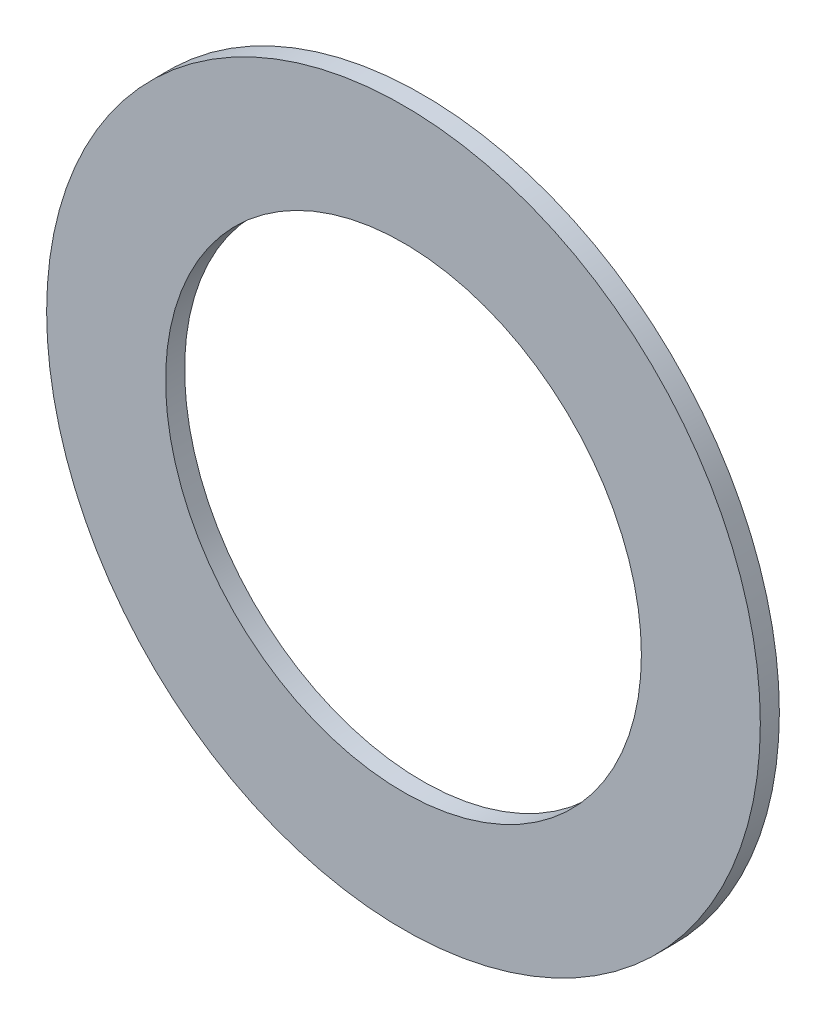
ISO-10303-21;
HEADER;
FILE_DESCRIPTION(('STEP AP214'),'2;1');
FILE_NAME('part.step','',(''),(''),'','','');
FILE_SCHEMA(('AUTOMOTIVE_DESIGN { 1 0 10303 214 1 1 1 1 }'));
ENDSEC;
DATA;
#1=APPLICATION_CONTEXT('core data for automotive mechanical design processes');
#2=APPLICATION_PROTOCOL_DEFINITION('international standard','automotive_design',2000,#1);
#3=PRODUCT_CONTEXT('',#1,'mechanical');
#4=PRODUCT('Part','Part','',(#3));
#5=PRODUCT_RELATED_PRODUCT_CATEGORY('part','',(#4));
#6=PRODUCT_DEFINITION_FORMATION('','',#4);
#7=PRODUCT_DEFINITION_CONTEXT('part definition',#1,'design');
#8=PRODUCT_DEFINITION('design','',#6,#7);
#9=PRODUCT_DEFINITION_SHAPE('','',#8);
#10=(LENGTH_UNIT() NAMED_UNIT(*) SI_UNIT(.MILLI.,.METRE.));
#11=(NAMED_UNIT(*) PLANE_ANGLE_UNIT() SI_UNIT($,.RADIAN.));
#12=(NAMED_UNIT(*) SI_UNIT($,.STERADIAN.) SOLID_ANGLE_UNIT());
#13=UNCERTAINTY_MEASURE_WITH_UNIT(LENGTH_MEASURE(1.E-05),#10,'distance_accuracy_value','');
#14=(GEOMETRIC_REPRESENTATION_CONTEXT(3) GLOBAL_UNCERTAINTY_ASSIGNED_CONTEXT((#13)) GLOBAL_UNIT_ASSIGNED_CONTEXT((#10,
#11,#12)) REPRESENTATION_CONTEXT('',''));
#15=CARTESIAN_POINT('',(0.,0.,0.));
#16=DIRECTION('',(0.,0.,1.));
#17=DIRECTION('',(1.,0.,0.));
#18=AXIS2_PLACEMENT_3D('',#15,#16,#17);
#19=CARTESIAN_POINT('',(0.,0.,0.254));
#20=DIRECTION('',(0.,0.,1.));
#21=DIRECTION('',(1.,0.,0.));
#22=AXIS2_PLACEMENT_3D('',#19,#20,#21);
#23=PLANE('',#22);
#24=CARTESIAN_POINT('',(0.,0.,0.254));
#25=DIRECTION('',(0.,0.,1.));
#26=DIRECTION('',(1.,0.,0.));
#27=AXIS2_PLACEMENT_3D('',#24,#25,#26);
#28=CIRCLE('',#27,4.7625);
#29=CARTESIAN_POINT('',(4.7625,0.,0.254));
#30=VERTEX_POINT('',#29);
#31=EDGE_CURVE('E10',#30,#30,#28,.T.);
#32=ORIENTED_EDGE('',*,*,#31,.T.);
#33=EDGE_LOOP('',(#32));
#34=FACE_BOUND('',#33,.T.);
#35=CARTESIAN_POINT('',(0.,0.,0.254));
#36=DIRECTION('',(0.,0.,1.));
#37=DIRECTION('',(1.,0.,0.));
#38=AXIS2_PLACEMENT_3D('',#35,#36,#37);
#39=CIRCLE('',#38,3.175);
#40=CARTESIAN_POINT('',(3.175,0.,0.254));
#41=VERTEX_POINT('',#40);
#42=EDGE_CURVE('E50',#41,#41,#39,.T.);
#43=ORIENTED_EDGE('',*,*,#42,.F.);
#44=EDGE_LOOP('',(#43));
#45=FACE_BOUND('',#44,.T.);
#46=ADVANCED_FACE('F36',(#34,#45),#23,.T.);
#47=CARTESIAN_POINT('',(0.,0.,0.));
#48=DIRECTION('',(0.,0.,1.));
#49=DIRECTION('',(1.,0.,0.));
#50=AXIS2_PLACEMENT_3D('',#47,#48,#49);
#51=PLANE('',#50);
#52=CARTESIAN_POINT('',(0.,0.,0.));
#53=DIRECTION('',(0.,0.,1.));
#54=DIRECTION('',(1.,0.,0.));
#55=AXIS2_PLACEMENT_3D('',#52,#53,#54);
#56=CIRCLE('',#55,4.7625);
#57=CARTESIAN_POINT('',(4.7625,0.,0.));
#58=VERTEX_POINT('',#57);
#59=EDGE_CURVE('E44',#58,#58,#56,.T.);
#60=ORIENTED_EDGE('',*,*,#59,.F.);
#61=EDGE_LOOP('',(#60));
#62=FACE_BOUND('',#61,.T.);
#63=CARTESIAN_POINT('',(0.,0.,0.));
#64=DIRECTION('',(0.,0.,1.));
#65=DIRECTION('',(1.,0.,0.));
#66=AXIS2_PLACEMENT_3D('',#63,#64,#65);
#67=CIRCLE('',#66,3.175);
#68=CARTESIAN_POINT('',(3.175,0.,0.));
#69=VERTEX_POINT('',#68);
#70=EDGE_CURVE('E55',#69,#69,#67,.T.);
#71=ORIENTED_EDGE('',*,*,#70,.T.);
#72=EDGE_LOOP('',(#71));
#73=FACE_BOUND('',#72,.T.);
#74=ADVANCED_FACE('F61',(#62,#73),#51,.F.);
#75=CARTESIAN_POINT('',(0.,0.,0.254));
#76=DIRECTION('',(0.,0.,-1.));
#77=DIRECTION('',(-1.,0.,0.));
#78=AXIS2_PLACEMENT_3D('',#75,#76,#77);
#79=CYLINDRICAL_SURFACE('',#78,4.7625);
#80=ORIENTED_EDGE('',*,*,#31,.F.);
#81=EDGE_LOOP('',(#80));
#82=FACE_BOUND('',#81,.T.);
#83=ORIENTED_EDGE('',*,*,#59,.T.);
#84=EDGE_LOOP('',(#83));
#85=FACE_BOUND('',#84,.T.);
#86=ADVANCED_FACE('F38',(#82,#85),#79,.T.);
#87=CARTESIAN_POINT('',(0.,0.,0.254));
#88=DIRECTION('',(0.,0.,-1.));
#89=DIRECTION('',(-1.,0.,0.));
#90=AXIS2_PLACEMENT_3D('',#87,#88,#89);
#91=CYLINDRICAL_SURFACE('',#90,3.175);
#92=ORIENTED_EDGE('',*,*,#42,.T.);
#93=EDGE_LOOP('',(#92));
#94=FACE_BOUND('',#93,.T.);
#95=ORIENTED_EDGE('',*,*,#70,.F.);
#96=EDGE_LOOP('',(#95));
#97=FACE_BOUND('',#96,.T.);
#98=ADVANCED_FACE('F63',(#94,#97),#91,.F.);
#99=CLOSED_SHELL('',(#46,#74,#86,#98));
#100=MANIFOLD_SOLID_BREP('B2',#99);
#101=ADVANCED_BREP_SHAPE_REPRESENTATION('',(#18,#100),#14);
#102=SHAPE_DEFINITION_REPRESENTATION(#9,#101);
ENDSEC;
END-ISO-10303-21;
